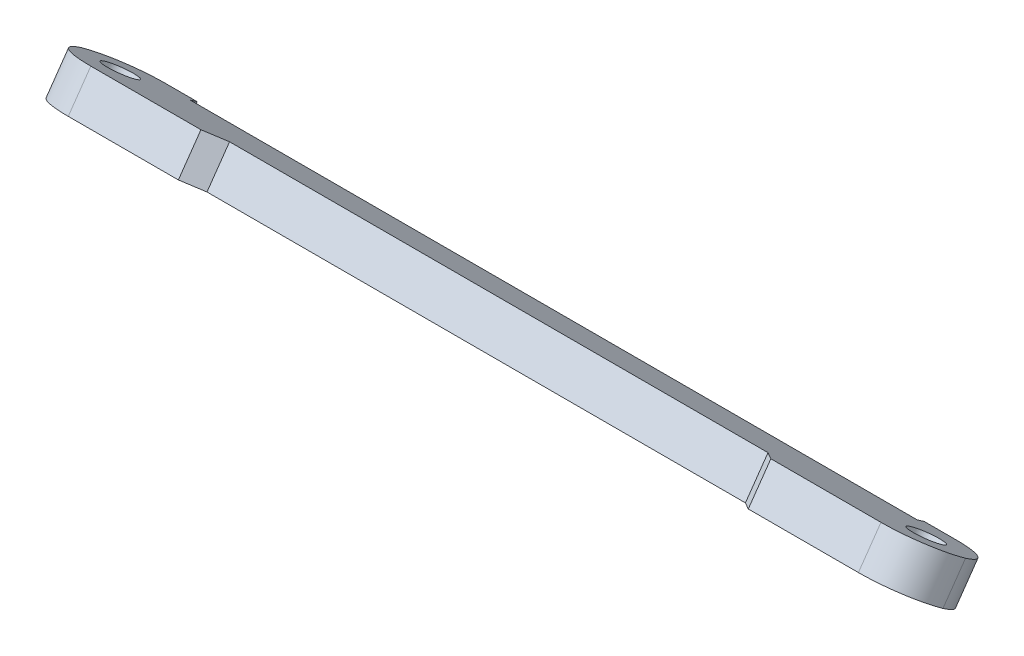
ISO-10303-21;
HEADER;
FILE_DESCRIPTION(('STEP AP214'),'2;1');
FILE_NAME('part.step','',(''),(''),'','','');
FILE_SCHEMA(('AUTOMOTIVE_DESIGN { 1 0 10303 214 1 1 1 1 }'));
ENDSEC;
DATA;
#1=APPLICATION_CONTEXT('core data for automotive mechanical design processes');
#2=APPLICATION_PROTOCOL_DEFINITION('international standard','automotive_design',2000,#1);
#3=PRODUCT_CONTEXT('',#1,'mechanical');
#4=PRODUCT('Part','Part','',(#3));
#5=PRODUCT_RELATED_PRODUCT_CATEGORY('part','',(#4));
#6=PRODUCT_DEFINITION_FORMATION('','',#4);
#7=PRODUCT_DEFINITION_CONTEXT('part definition',#1,'design');
#8=PRODUCT_DEFINITION('design','',#6,#7);
#9=PRODUCT_DEFINITION_SHAPE('','',#8);
#10=(LENGTH_UNIT() NAMED_UNIT(*) SI_UNIT(.MILLI.,.METRE.));
#11=(NAMED_UNIT(*) PLANE_ANGLE_UNIT() SI_UNIT($,.RADIAN.));
#12=(NAMED_UNIT(*) SI_UNIT($,.STERADIAN.) SOLID_ANGLE_UNIT());
#13=UNCERTAINTY_MEASURE_WITH_UNIT(LENGTH_MEASURE(1.E-05),#10,'distance_accuracy_value','');
#14=(GEOMETRIC_REPRESENTATION_CONTEXT(3) GLOBAL_UNCERTAINTY_ASSIGNED_CONTEXT((#13)) GLOBAL_UNIT_ASSIGNED_CONTEXT((#10,
#11,#12)) REPRESENTATION_CONTEXT('',''));
#15=CARTESIAN_POINT('',(0.,0.,0.));
#16=DIRECTION('',(0.,0.,1.));
#17=DIRECTION('',(1.,0.,0.));
#18=AXIS2_PLACEMENT_3D('',#15,#16,#17);
#19=CARTESIAN_POINT('',(0.,-6.96279237645662,4.87539970898395));
#20=DIRECTION('',(0.,-0.819152044288996,0.57357643635104));
#21=DIRECTION('',(0.,-0.57357643635104,-0.819152044288996));
#22=AXIS2_PLACEMENT_3D('',#19,#20,#21);
#23=PLANE('',#22);
#24=DIRECTION('',(1.,0.,0.));
#25=VECTOR('',#24,1.);
#26=CARTESIAN_POINT('',(56.2272925792625,-61.3939853444137,-72.8604000328006));
#27=LINE('',#26,#25);
#28=CARTESIAN_POINT('',(46.2272925792625,-61.3939853444137,-72.8604000328006));
#29=VERTEX_POINT('',#28);
#30=CARTESIAN_POINT('',(50.2272925792626,-61.3939853444137,-72.8604000328006));
#31=VERTEX_POINT('',#30);
#32=EDGE_CURVE('E152',#29,#31,#27,.T.);
#33=ORIENTED_EDGE('',*,*,#32,.T.);
#34=CARTESIAN_POINT('',(50.2272925792625,-57.9525267263075,-67.9454877670666));
#35=DIRECTION('',(0.,-0.819152044288996,0.57357643635104));
#36=DIRECTION('',(0.,-0.57357643635104,-0.819152044288996));
#37=AXIS2_PLACEMENT_3D('',#34,#35,#36);
#38=CIRCLE('',#37,6.);
#39=CARTESIAN_POINT('',(56.2240737994074,-58.0652385062237,-68.1064568708903));
#40=VERTEX_POINT('',#39);
#41=EDGE_CURVE('E50',#31,#40,#38,.T.);
#42=ORIENTED_EDGE('',*,*,#41,.T.);
#43=CARTESIAN_POINT('',(50.2272925792625,-58.1779502861398,-68.2674259747139));
#44=DIRECTION('',(0.,-0.819152044288996,0.57357643635104));
#45=DIRECTION('',(0.,-0.57357643635104,-0.819152044288996));
#46=AXIS2_PLACEMENT_3D('',#43,#44,#45);
#47=CIRCLE('',#46,6.);
#48=CARTESIAN_POINT('',(50.2272925792625,-54.7364916680336,-63.3525137089799));
#49=VERTEX_POINT('',#48);
#50=EDGE_CURVE('E223',#40,#49,#47,.T.);
#51=ORIENTED_EDGE('',*,*,#50,.T.);
#52=DIRECTION('',(-1.,0.,0.));
#53=VECTOR('',#52,1.);
#54=CARTESIAN_POINT('',(36.2272925792625,-54.7364916680336,-63.3525137089799));
#55=LINE('',#54,#53);
#56=CARTESIAN_POINT('',(36.2272925792625,-54.7364916680336,-63.3525137089799));
#57=VERTEX_POINT('',#56);
#58=EDGE_CURVE('E267',#49,#57,#55,.T.);
#59=ORIENTED_EDGE('',*,*,#58,.T.);
#60=DIRECTION('',(-0.707106781186548,-0.405579787672634,-0.579227965339572));
#61=VECTOR('',#60,1.);
#62=CARTESIAN_POINT('',(36.2272925792625,-54.7364916680336,-63.3525137089799));
#63=LINE('',#62,#61);
#64=CARTESIAN_POINT('',(34.2272925792625,-55.8836445407357,-64.9908177975579));
#65=VERTEX_POINT('',#64);
#66=EDGE_CURVE('E200',#57,#65,#63,.T.);
#67=ORIENTED_EDGE('',*,*,#66,.T.);
#68=DIRECTION('',(-1.,0.,0.));
#69=VECTOR('',#68,1.);
#70=CARTESIAN_POINT('',(-36.2272925792626,-55.8836445407357,-64.9908177975579));
#71=LINE('',#70,#69);
#72=CARTESIAN_POINT('',(-34.2272925792625,-55.8836445407357,-64.9908177975579));
#73=VERTEX_POINT('',#72);
#74=EDGE_CURVE('E159',#65,#73,#71,.T.);
#75=ORIENTED_EDGE('',*,*,#74,.T.);
#76=DIRECTION('',(-0.707106781186551,0.405579787672633,0.579227965339569));
#77=VECTOR('',#76,1.);
#78=CARTESIAN_POINT('',(-34.2272925792625,-55.8836445407357,-64.9908177975579));
#79=LINE('',#78,#77);
#80=CARTESIAN_POINT('',(-36.2272925792626,-54.7364916680336,-63.3525137089799));
#81=VERTEX_POINT('',#80);
#82=EDGE_CURVE('E205',#73,#81,#79,.T.);
#83=ORIENTED_EDGE('',*,*,#82,.T.);
#84=DIRECTION('',(-1.,0.,0.));
#85=VECTOR('',#84,1.);
#86=CARTESIAN_POINT('',(-36.2272925792626,-54.7364916680336,-63.3525137089799));
#87=LINE('',#86,#85);
#88=CARTESIAN_POINT('',(-50.2272925792626,-54.7364916680336,-63.3525137089799));
#89=VERTEX_POINT('',#88);
#90=EDGE_CURVE('E177',#81,#89,#87,.T.);
#91=ORIENTED_EDGE('',*,*,#90,.T.);
#92=CARTESIAN_POINT('',(-50.2272925792626,-58.1779502861398,-68.2674259747138));
#93=DIRECTION('',(0.,-0.819152044288996,0.57357643635104));
#94=DIRECTION('',(0.,-0.57357643635104,-0.819152044288996));
#95=AXIS2_PLACEMENT_3D('',#92,#93,#94);
#96=CIRCLE('',#95,6.);
#97=CARTESIAN_POINT('',(-56.2240737994074,-58.0652385062236,-68.1064568708902));
#98=VERTEX_POINT('',#97);
#99=EDGE_CURVE('E57',#89,#98,#96,.T.);
#100=ORIENTED_EDGE('',*,*,#99,.T.);
#101=CARTESIAN_POINT('',(-50.2272925792626,-57.9525267263075,-67.9454877670666));
#102=DIRECTION('',(0.,-0.819152044288996,0.57357643635104));
#103=DIRECTION('',(0.,-0.57357643635104,-0.819152044288996));
#104=AXIS2_PLACEMENT_3D('',#101,#102,#103);
#105=CIRCLE('',#104,6.);
#106=CARTESIAN_POINT('',(-50.2272925792627,-61.3939853444137,-72.8604000328006));
#107=VERTEX_POINT('',#106);
#108=EDGE_CURVE('E220',#98,#107,#105,.T.);
#109=ORIENTED_EDGE('',*,*,#108,.T.);
#110=DIRECTION('',(1.,0.,0.));
#111=VECTOR('',#110,1.);
#112=CARTESIAN_POINT('',(-56.2272925792626,-61.3939853444137,-72.8604000328005));
#113=LINE('',#112,#111);
#114=CARTESIAN_POINT('',(-46.2272925792625,-61.3939853444137,-72.8604000328006));
#115=VERTEX_POINT('',#114);
#116=EDGE_CURVE('E179',#107,#115,#113,.T.);
#117=ORIENTED_EDGE('',*,*,#116,.T.);
#118=DIRECTION('',(0.,0.573576436351034,0.819152044289));
#119=VECTOR('',#118,1.);
#120=CARTESIAN_POINT('',(-46.2272925792625,-61.3939853444137,-72.8604000328006));
#121=LINE('',#120,#119);
#122=CARTESIAN_POINT('',(-46.2272925792625,-60.7608298351204,-71.9561602542456));
#123=VERTEX_POINT('',#122);
#124=EDGE_CURVE('E138',#115,#123,#121,.T.);
#125=ORIENTED_EDGE('',*,*,#124,.T.);
#126=DIRECTION('',(1.,0.,0.));
#127=VECTOR('',#126,1.);
#128=CARTESIAN_POINT('',(-46.2272925792625,-60.7608298351204,-71.9561602542456));
#129=LINE('',#128,#127);
#130=CARTESIAN_POINT('',(46.2272925792625,-60.7608298351204,-71.9561602542456));
#131=VERTEX_POINT('',#130);
#132=EDGE_CURVE('E132',#123,#131,#129,.T.);
#133=ORIENTED_EDGE('',*,*,#132,.T.);
#134=DIRECTION('',(0.,-0.573576436351034,-0.819152044289));
#135=VECTOR('',#134,1.);
#136=CARTESIAN_POINT('',(46.2272925792625,-61.3939853444137,-72.8604000328006));
#137=LINE('',#136,#135);
#138=EDGE_CURVE('E135',#131,#29,#137,.T.);
#139=ORIENTED_EDGE('',*,*,#138,.T.);
#140=EDGE_LOOP('',(#33,#42,#51,#59,#67,#75,#83,#91,#100,#109,#117,#125,#133,#139));
#141=FACE_BOUND('',#140,.T.);
#142=CARTESIAN_POINT('',(-51.2272925792626,-58.0652385062236,-68.1064568708902));
#143=DIRECTION('',(0.,-0.819152044288996,0.57357643635104));
#144=DIRECTION('',(0.,-0.57357643635104,-0.819152044288996));
#145=AXIS2_PLACEMENT_3D('',#142,#143,#144);
#146=CIRCLE('',#145,2.);
#147=CARTESIAN_POINT('',(-51.2272925792626,-59.2123913789257,-69.7447609594682));
#148=VERTEX_POINT('',#147);
#149=EDGE_CURVE('E171',#148,#148,#146,.T.);
#150=ORIENTED_EDGE('',*,*,#149,.F.);
#151=EDGE_LOOP('',(#150));
#152=FACE_BOUND('',#151,.T.);
#153=CARTESIAN_POINT('',(51.2272925792626,-58.0652385062236,-68.1064568708902));
#154=DIRECTION('',(0.,-0.819152044288996,0.57357643635104));
#155=DIRECTION('',(0.,0.57357643635104,0.819152044288996));
#156=AXIS2_PLACEMENT_3D('',#153,#154,#155);
#157=CIRCLE('',#156,2.);
#158=CARTESIAN_POINT('',(51.2272925792626,-56.9180856335215,-66.4681527823122));
#159=VERTEX_POINT('',#158);
#160=EDGE_CURVE('E236',#159,#159,#157,.T.);
#161=ORIENTED_EDGE('',*,*,#160,.F.);
#162=EDGE_LOOP('',(#161));
#163=FACE_BOUND('',#162,.T.);
#164=ADVANCED_FACE('F33',(#141,#152,#163),#23,.T.);
#165=CARTESIAN_POINT('',(0.,-2.86703215501164,2.00751752722875));
#166=DIRECTION('',(0.,-0.819152044288996,0.57357643635104));
#167=DIRECTION('',(0.,-0.57357643635104,-0.819152044288996));
#168=AXIS2_PLACEMENT_3D('',#165,#166,#167);
#169=PLANE('',#168);
#170=CARTESIAN_POINT('',(50.2272925792625,-54.0821900646949,-71.1353081564691));
#171=DIRECTION('',(0.,-0.819152044288996,0.57357643635104));
#172=DIRECTION('',(0.,-0.57357643635104,-0.819152044288996));
#173=AXIS2_PLACEMENT_3D('',#170,#171,#172);
#174=CIRCLE('',#173,6.);
#175=CARTESIAN_POINT('',(50.2272925792625,-50.6407314465886,-66.2203958907351));
#176=VERTEX_POINT('',#175);
#177=CARTESIAN_POINT('',(56.2240737994074,-53.9694782847787,-70.9743390526455));
#178=VERTEX_POINT('',#177);
#179=EDGE_CURVE('E213',#176,#178,#174,.F.);
#180=ORIENTED_EDGE('',*,*,#179,.T.);
#181=CARTESIAN_POINT('',(50.2272925792625,-53.8567665048625,-70.8133699488218));
#182=DIRECTION('',(0.,-0.819152044288996,0.57357643635104));
#183=DIRECTION('',(0.,-0.57357643635104,-0.819152044288996));
#184=AXIS2_PLACEMENT_3D('',#181,#182,#183);
#185=CIRCLE('',#184,6.);
#186=CARTESIAN_POINT('',(50.2272925792626,-57.2982251229687,-75.7282822145558));
#187=VERTEX_POINT('',#186);
#188=EDGE_CURVE('E215',#178,#187,#185,.F.);
#189=ORIENTED_EDGE('',*,*,#188,.T.);
#190=DIRECTION('',(1.,0.,0.));
#191=VECTOR('',#190,1.);
#192=CARTESIAN_POINT('',(56.2272925792625,-57.2982251229687,-75.7282822145558));
#193=LINE('',#192,#191);
#194=CARTESIAN_POINT('',(46.2272925792625,-57.2982251229688,-75.7282822145558));
#195=VERTEX_POINT('',#194);
#196=EDGE_CURVE('E261',#195,#187,#193,.T.);
#197=ORIENTED_EDGE('',*,*,#196,.F.);
#198=DIRECTION('',(0.,-0.573576436351034,-0.819152044289));
#199=VECTOR('',#198,1.);
#200=CARTESIAN_POINT('',(46.2272925792625,-57.2982251229688,-75.7282822145558));
#201=LINE('',#200,#199);
#202=CARTESIAN_POINT('',(46.2272925792625,-56.6650696136755,-74.8240424360008));
#203=VERTEX_POINT('',#202);
#204=EDGE_CURVE('E259',#203,#195,#201,.T.);
#205=ORIENTED_EDGE('',*,*,#204,.F.);
#206=DIRECTION('',(1.,0.,0.));
#207=VECTOR('',#206,1.);
#208=CARTESIAN_POINT('',(-46.2272925792625,-56.6650696136755,-74.8240424360008));
#209=LINE('',#208,#207);
#210=CARTESIAN_POINT('',(-46.2272925792625,-56.6650696136755,-74.8240424360008));
#211=VERTEX_POINT('',#210);
#212=EDGE_CURVE('E157',#211,#203,#209,.T.);
#213=ORIENTED_EDGE('',*,*,#212,.F.);
#214=DIRECTION('',(0.,0.573576436351034,0.819152044289));
#215=VECTOR('',#214,1.);
#216=CARTESIAN_POINT('',(-46.2272925792625,-57.2982251229688,-75.7282822145558));
#217=LINE('',#216,#215);
#218=CARTESIAN_POINT('',(-46.2272925792625,-57.2982251229688,-75.7282822145558));
#219=VERTEX_POINT('',#218);
#220=EDGE_CURVE('E186',#219,#211,#217,.T.);
#221=ORIENTED_EDGE('',*,*,#220,.F.);
#222=DIRECTION('',(1.,0.,0.));
#223=VECTOR('',#222,1.);
#224=CARTESIAN_POINT('',(-56.2272925792626,-57.2982251229687,-75.7282822145557));
#225=LINE('',#224,#223);
#226=CARTESIAN_POINT('',(-50.2272925792627,-57.2982251229687,-75.7282822145558));
#227=VERTEX_POINT('',#226);
#228=EDGE_CURVE('E184',#227,#219,#225,.T.);
#229=ORIENTED_EDGE('',*,*,#228,.F.);
#230=CARTESIAN_POINT('',(-50.2272925792626,-53.8567665048625,-70.8133699488218));
#231=DIRECTION('',(0.,-0.819152044288996,0.57357643635104));
#232=DIRECTION('',(0.,-0.57357643635104,-0.819152044288996));
#233=AXIS2_PLACEMENT_3D('',#230,#231,#232);
#234=CIRCLE('',#233,6.);
#235=CARTESIAN_POINT('',(-56.2240737994074,-53.9694782847787,-70.9743390526454));
#236=VERTEX_POINT('',#235);
#237=EDGE_CURVE('E209',#227,#236,#234,.F.);
#238=ORIENTED_EDGE('',*,*,#237,.T.);
#239=CARTESIAN_POINT('',(-50.2272925792626,-54.0821900646948,-71.135308156469));
#240=DIRECTION('',(0.,-0.819152044288996,0.57357643635104));
#241=DIRECTION('',(0.,-0.57357643635104,-0.819152044288996));
#242=AXIS2_PLACEMENT_3D('',#239,#240,#241);
#243=CIRCLE('',#242,6.);
#244=CARTESIAN_POINT('',(-50.2272925792626,-50.6407314465886,-66.2203958907351));
#245=VERTEX_POINT('',#244);
#246=EDGE_CURVE('E211',#236,#245,#243,.F.);
#247=ORIENTED_EDGE('',*,*,#246,.T.);
#248=DIRECTION('',(-1.,0.,0.));
#249=VECTOR('',#248,1.);
#250=CARTESIAN_POINT('',(-36.2272925792626,-50.6407314465886,-66.2203958907351));
#251=LINE('',#250,#249);
#252=CARTESIAN_POINT('',(-36.2272925792626,-50.6407314465886,-66.2203958907351));
#253=VERTEX_POINT('',#252);
#254=EDGE_CURVE('E174',#253,#245,#251,.T.);
#255=ORIENTED_EDGE('',*,*,#254,.F.);
#256=DIRECTION('',(0.707106781186551,-0.405579787672633,-0.579227965339569));
#257=VECTOR('',#256,1.);
#258=CARTESIAN_POINT('',(-59.7590977620644,-37.1434424889303,-46.9442695694328));
#259=LINE('',#258,#257);
#260=CARTESIAN_POINT('',(-34.2272925792625,-51.7878843192907,-67.8586999793131));
#261=VERTEX_POINT('',#260);
#262=EDGE_CURVE('E207',#253,#261,#259,.T.);
#263=ORIENTED_EDGE('',*,*,#262,.T.);
#264=DIRECTION('',(-1.,0.,0.));
#265=VECTOR('',#264,1.);
#266=CARTESIAN_POINT('',(-36.2272925792626,-51.7878843192907,-67.8586999793131));
#267=LINE('',#266,#265);
#268=CARTESIAN_POINT('',(34.2272925792625,-51.7878843192907,-67.8586999793131));
#269=VERTEX_POINT('',#268);
#270=EDGE_CURVE('E162',#269,#261,#267,.T.);
#271=ORIENTED_EDGE('',*,*,#270,.F.);
#272=DIRECTION('',(0.707106781186548,0.405579787672634,0.579227965339572));
#273=VECTOR('',#272,1.);
#274=CARTESIAN_POINT('',(59.7590977620646,-37.1434424889301,-46.9442695694324));
#275=LINE('',#274,#273);
#276=CARTESIAN_POINT('',(36.2272925792625,-50.6407314465886,-66.2203958907351));
#277=VERTEX_POINT('',#276);
#278=EDGE_CURVE('E202',#269,#277,#275,.T.);
#279=ORIENTED_EDGE('',*,*,#278,.T.);
#280=DIRECTION('',(-1.,0.,0.));
#281=VECTOR('',#280,1.);
#282=CARTESIAN_POINT('',(36.2272925792625,-50.6407314465886,-66.2203958907351));
#283=LINE('',#282,#281);
#284=EDGE_CURVE('E153',#176,#277,#283,.T.);
#285=ORIENTED_EDGE('',*,*,#284,.F.);
#286=EDGE_LOOP('',(#180,#189,#197,#205,#213,#221,#229,#238,#247,#255,#263,#271,#279,#285));
#287=FACE_BOUND('',#286,.T.);
#288=CARTESIAN_POINT('',(-51.2272925792626,-53.9694782847786,-70.9743390526454));
#289=DIRECTION('',(0.,-0.819152044288996,0.57357643635104));
#290=DIRECTION('',(0.,-0.57357643635104,-0.819152044288996));
#291=AXIS2_PLACEMENT_3D('',#288,#289,#290);
#292=CIRCLE('',#291,2.);
#293=CARTESIAN_POINT('',(-51.2272925792626,-55.1166311574807,-72.6126431412234));
#294=VERTEX_POINT('',#293);
#295=EDGE_CURVE('E169',#294,#294,#292,.T.);
#296=ORIENTED_EDGE('',*,*,#295,.T.);
#297=EDGE_LOOP('',(#296));
#298=FACE_BOUND('',#297,.T.);
#299=CARTESIAN_POINT('',(51.2272925792626,-53.9694782847786,-70.9743390526454));
#300=DIRECTION('',(0.,-0.819152044288996,0.57357643635104));
#301=DIRECTION('',(0.,0.57357643635104,0.819152044288996));
#302=AXIS2_PLACEMENT_3D('',#299,#300,#301);
#303=CIRCLE('',#302,2.);
#304=CARTESIAN_POINT('',(51.2272925792626,-52.8223254120765,-69.3360349640674));
#305=VERTEX_POINT('',#304);
#306=EDGE_CURVE('E231',#305,#305,#303,.T.);
#307=ORIENTED_EDGE('',*,*,#306,.T.);
#308=EDGE_LOOP('',(#307));
#309=FACE_BOUND('',#308,.T.);
#310=ADVANCED_FACE('F256',(#287,#298,#309),#169,.F.);
#311=CARTESIAN_POINT('',(-36.2272925792626,-54.7364916680336,-63.3525137089799));
#312=DIRECTION('',(0.,-0.57357643635104,-0.819152044288996));
#313=DIRECTION('',(0.,0.819152044288996,-0.57357643635104));
#314=AXIS2_PLACEMENT_3D('',#311,#312,#313);
#315=PLANE('',#314);
#316=ORIENTED_EDGE('',*,*,#254,.T.);
#317=DIRECTION('',(0.,0.819152044288996,-0.57357643635104));
#318=VECTOR('',#317,1.);
#319=CARTESIAN_POINT('',(-50.2272925792626,-54.7364916680336,-63.3525137089799));
#320=LINE('',#319,#318);
#321=EDGE_CURVE('E42',#245,#89,#320,.F.);
#322=ORIENTED_EDGE('',*,*,#321,.T.);
#323=ORIENTED_EDGE('',*,*,#90,.F.);
#324=DIRECTION('',(0.,0.819152044288996,-0.57357643635104));
#325=VECTOR('',#324,1.);
#326=CARTESIAN_POINT('',(-36.2272925792626,-54.7364916680336,-63.3525137089799));
#327=LINE('',#326,#325);
#328=EDGE_CURVE('E143',#81,#253,#327,.T.);
#329=ORIENTED_EDGE('',*,*,#328,.T.);
#330=EDGE_LOOP('',(#316,#322,#323,#329));
#331=FACE_BOUND('',#330,.T.);
#332=ADVANCED_FACE('F298',(#331),#315,.F.);
#333=CARTESIAN_POINT('',(-56.2272925792626,-61.3939853444137,-72.8604000328005));
#334=DIRECTION('',(0.,0.57357643635104,0.819152044288996));
#335=DIRECTION('',(0.,-0.819152044288996,0.57357643635104));
#336=AXIS2_PLACEMENT_3D('',#333,#334,#335);
#337=PLANE('',#336);
#338=ORIENTED_EDGE('',*,*,#116,.F.);
#339=DIRECTION('',(0.,0.819152044288996,-0.57357643635104));
#340=VECTOR('',#339,1.);
#341=CARTESIAN_POINT('',(-50.2272925792627,-61.3939853444137,-72.8604000328006));
#342=LINE('',#341,#340);
#343=EDGE_CURVE('E11',#107,#227,#342,.T.);
#344=ORIENTED_EDGE('',*,*,#343,.T.);
#345=ORIENTED_EDGE('',*,*,#228,.T.);
#346=DIRECTION('',(0.,0.819152044288996,-0.57357643635104));
#347=VECTOR('',#346,1.);
#348=CARTESIAN_POINT('',(-46.2272925792625,-61.3939853444137,-72.8604000328006));
#349=LINE('',#348,#347);
#350=EDGE_CURVE('E192',#115,#219,#349,.T.);
#351=ORIENTED_EDGE('',*,*,#350,.F.);
#352=EDGE_LOOP('',(#338,#344,#345,#351));
#353=FACE_BOUND('',#352,.T.);
#354=ADVANCED_FACE('F250',(#353),#337,.F.);
#355=CARTESIAN_POINT('',(-46.2272925792625,-61.3939853444137,-72.8604000328006));
#356=DIRECTION('',(-1.,0.,0.));
#357=DIRECTION('',(0.,0.,1.));
#358=AXIS2_PLACEMENT_3D('',#355,#356,#357);
#359=PLANE('',#358);
#360=ORIENTED_EDGE('',*,*,#220,.T.);
#361=DIRECTION('',(0.,0.819152044288996,-0.57357643635104));
#362=VECTOR('',#361,1.);
#363=CARTESIAN_POINT('',(-46.2272925792625,-60.7608298351204,-71.9561602542456));
#364=LINE('',#363,#362);
#365=EDGE_CURVE('E190',#123,#211,#364,.T.);
#366=ORIENTED_EDGE('',*,*,#365,.F.);
#367=ORIENTED_EDGE('',*,*,#124,.F.);
#368=ORIENTED_EDGE('',*,*,#350,.T.);
#369=EDGE_LOOP('',(#360,#366,#367,#368));
#370=FACE_BOUND('',#369,.T.);
#371=ADVANCED_FACE('F254',(#370),#359,.F.);
#372=CARTESIAN_POINT('',(-46.2272925792625,-60.7608298351204,-71.9561602542456));
#373=DIRECTION('',(0.,0.57357643635104,0.819152044288996));
#374=DIRECTION('',(0.,-0.819152044288996,0.57357643635104));
#375=AXIS2_PLACEMENT_3D('',#372,#373,#374);
#376=PLANE('',#375);
#377=ORIENTED_EDGE('',*,*,#212,.T.);
#378=DIRECTION('',(0.,0.819152044288996,-0.57357643635104));
#379=VECTOR('',#378,1.);
#380=CARTESIAN_POINT('',(46.2272925792625,-60.7608298351204,-71.9561602542456));
#381=LINE('',#380,#379);
#382=EDGE_CURVE('E148',#131,#203,#381,.T.);
#383=ORIENTED_EDGE('',*,*,#382,.F.);
#384=ORIENTED_EDGE('',*,*,#132,.F.);
#385=ORIENTED_EDGE('',*,*,#365,.T.);
#386=EDGE_LOOP('',(#377,#383,#384,#385));
#387=FACE_BOUND('',#386,.T.);
#388=ADVANCED_FACE('F155',(#387),#376,.F.);
#389=CARTESIAN_POINT('',(-51.2272925792626,-58.0652385062236,-68.1064568708902));
#390=DIRECTION('',(0.,0.819152044288996,-0.57357643635104));
#391=DIRECTION('',(0.,0.57357643635104,0.819152044288996));
#392=AXIS2_PLACEMENT_3D('',#389,#390,#391);
#393=CYLINDRICAL_SURFACE('',#392,2.);
#394=ORIENTED_EDGE('',*,*,#149,.T.);
#395=EDGE_LOOP('',(#394));
#396=FACE_BOUND('',#395,.T.);
#397=ORIENTED_EDGE('',*,*,#295,.F.);
#398=EDGE_LOOP('',(#397));
#399=FACE_BOUND('',#398,.T.);
#400=ADVANCED_FACE('F319',(#396,#399),#393,.F.);
#401=CARTESIAN_POINT('',(-36.2272925792626,-51.7878843192907,-67.8586999793131));
#402=DIRECTION('',(0.,0.57357643635104,0.819152044288996));
#403=DIRECTION('',(0.,-0.819152044288996,0.57357643635104));
#404=AXIS2_PLACEMENT_3D('',#401,#402,#403);
#405=PLANE('',#404);
#406=ORIENTED_EDGE('',*,*,#74,.F.);
#407=DIRECTION('',(0.,0.819152044288996,-0.57357643635104));
#408=VECTOR('',#407,1.);
#409=CARTESIAN_POINT('',(34.2272925792625,-51.7878843192907,-67.8586999793131));
#410=LINE('',#409,#408);
#411=EDGE_CURVE('E198',#65,#269,#410,.T.);
#412=ORIENTED_EDGE('',*,*,#411,.T.);
#413=ORIENTED_EDGE('',*,*,#270,.T.);
#414=DIRECTION('',(0.,-0.819152044288996,0.57357643635104));
#415=VECTOR('',#414,1.);
#416=CARTESIAN_POINT('',(-34.2272925792625,-51.7878843192907,-67.8586999793131));
#417=LINE('',#416,#415);
#418=EDGE_CURVE('E195',#261,#73,#417,.T.);
#419=ORIENTED_EDGE('',*,*,#418,.T.);
#420=EDGE_LOOP('',(#406,#412,#413,#419));
#421=FACE_BOUND('',#420,.T.);
#422=ADVANCED_FACE('F292',(#421),#405,.T.);
#423=CARTESIAN_POINT('',(46.2272925792625,-61.3939853444137,-72.8604000328006));
#424=DIRECTION('',(1.,0.,0.));
#425=DIRECTION('',(0.,0.,-1.));
#426=AXIS2_PLACEMENT_3D('',#423,#424,#425);
#427=PLANE('',#426);
#428=ORIENTED_EDGE('',*,*,#204,.T.);
#429=DIRECTION('',(0.,0.819152044288996,-0.57357643635104));
#430=VECTOR('',#429,1.);
#431=CARTESIAN_POINT('',(46.2272925792625,-61.3939853444137,-72.8604000328006));
#432=LINE('',#431,#430);
#433=EDGE_CURVE('E150',#29,#195,#432,.T.);
#434=ORIENTED_EDGE('',*,*,#433,.F.);
#435=ORIENTED_EDGE('',*,*,#138,.F.);
#436=ORIENTED_EDGE('',*,*,#382,.T.);
#437=EDGE_LOOP('',(#428,#434,#435,#436));
#438=FACE_BOUND('',#437,.T.);
#439=ADVANCED_FACE('F147',(#438),#427,.F.);
#440=CARTESIAN_POINT('',(56.2272925792625,-61.3939853444137,-72.8604000328006));
#441=DIRECTION('',(0.,0.57357643635104,0.819152044288996));
#442=DIRECTION('',(0.,-0.819152044288996,0.57357643635104));
#443=AXIS2_PLACEMENT_3D('',#440,#441,#442);
#444=PLANE('',#443);
#445=ORIENTED_EDGE('',*,*,#196,.T.);
#446=DIRECTION('',(0.,0.819152044288996,-0.57357643635104));
#447=VECTOR('',#446,1.);
#448=CARTESIAN_POINT('',(50.2272925792626,-61.3939853444137,-72.8604000328006));
#449=LINE('',#448,#447);
#450=EDGE_CURVE('E217',#187,#31,#449,.F.);
#451=ORIENTED_EDGE('',*,*,#450,.T.);
#452=ORIENTED_EDGE('',*,*,#32,.F.);
#453=ORIENTED_EDGE('',*,*,#433,.T.);
#454=EDGE_LOOP('',(#445,#451,#452,#453));
#455=FACE_BOUND('',#454,.T.);
#456=ADVANCED_FACE('F277',(#455),#444,.F.);
#457=CARTESIAN_POINT('',(36.2272925792625,-54.7364916680336,-63.3525137089799));
#458=DIRECTION('',(0.,-0.57357643635104,-0.819152044288996));
#459=DIRECTION('',(0.,0.819152044288996,-0.57357643635104));
#460=AXIS2_PLACEMENT_3D('',#457,#458,#459);
#461=PLANE('',#460);
#462=ORIENTED_EDGE('',*,*,#58,.F.);
#463=DIRECTION('',(0.,0.819152044288996,-0.57357643635104));
#464=VECTOR('',#463,1.);
#465=CARTESIAN_POINT('',(50.2272925792625,-54.7364916680336,-63.3525137089799));
#466=LINE('',#465,#464);
#467=EDGE_CURVE('E226',#49,#176,#466,.T.);
#468=ORIENTED_EDGE('',*,*,#467,.T.);
#469=ORIENTED_EDGE('',*,*,#284,.T.);
#470=DIRECTION('',(0.,0.819152044288996,-0.57357643635104));
#471=VECTOR('',#470,1.);
#472=CARTESIAN_POINT('',(36.2272925792625,-54.7364916680336,-63.3525137089799));
#473=LINE('',#472,#471);
#474=EDGE_CURVE('E164',#57,#277,#473,.T.);
#475=ORIENTED_EDGE('',*,*,#474,.F.);
#476=EDGE_LOOP('',(#462,#468,#469,#475));
#477=FACE_BOUND('',#476,.T.);
#478=ADVANCED_FACE('F286',(#477),#461,.F.);
#479=CARTESIAN_POINT('',(51.2272925792626,-58.0652385062236,-68.1064568708902));
#480=DIRECTION('',(0.,0.819152044288996,-0.57357643635104));
#481=DIRECTION('',(0.,0.57357643635104,0.819152044288996));
#482=AXIS2_PLACEMENT_3D('',#479,#480,#481);
#483=CYLINDRICAL_SURFACE('',#482,2.);
#484=ORIENTED_EDGE('',*,*,#160,.T.);
#485=EDGE_LOOP('',(#484));
#486=FACE_BOUND('',#485,.T.);
#487=ORIENTED_EDGE('',*,*,#306,.F.);
#488=EDGE_LOOP('',(#487));
#489=FACE_BOUND('',#488,.T.);
#490=ADVANCED_FACE('F309',(#486,#489),#483,.F.);
#491=CARTESIAN_POINT('',(36.2272925792625,-54.7364916680336,-63.3525137089799));
#492=DIRECTION('',(0.707106781186547,-0.405579787672635,-0.579227965339572));
#493=DIRECTION('',(0.,-0.819152044288996,0.57357643635104));
#494=AXIS2_PLACEMENT_3D('',#491,#492,#493);
#495=PLANE('',#494);
#496=ORIENTED_EDGE('',*,*,#278,.F.);
#497=ORIENTED_EDGE('',*,*,#411,.F.);
#498=ORIENTED_EDGE('',*,*,#66,.F.);
#499=ORIENTED_EDGE('',*,*,#474,.T.);
#500=EDGE_LOOP('',(#496,#497,#498,#499));
#501=FACE_BOUND('',#500,.T.);
#502=ADVANCED_FACE('F289',(#501),#495,.F.);
#503=CARTESIAN_POINT('',(-34.2272925792625,-51.7878843192907,-67.8586999793131));
#504=DIRECTION('',(-0.707106781186544,-0.405579787672637,-0.579227965339575));
#505=DIRECTION('',(0.,-0.819152044288996,0.57357643635104));
#506=AXIS2_PLACEMENT_3D('',#503,#504,#505);
#507=PLANE('',#506);
#508=ORIENTED_EDGE('',*,*,#262,.F.);
#509=ORIENTED_EDGE('',*,*,#328,.F.);
#510=ORIENTED_EDGE('',*,*,#82,.F.);
#511=ORIENTED_EDGE('',*,*,#418,.F.);
#512=EDGE_LOOP('',(#508,#509,#510,#511));
#513=FACE_BOUND('',#512,.T.);
#514=ADVANCED_FACE('F301',(#513),#507,.F.);
#515=CARTESIAN_POINT('',(50.2272925792625,-58.1779502861398,-68.2674259747139));
#516=DIRECTION('',(0.,0.819152044288996,-0.57357643635104));
#517=DIRECTION('',(0.,0.57357643635104,0.819152044288996));
#518=AXIS2_PLACEMENT_3D('',#515,#516,#517);
#519=CYLINDRICAL_SURFACE('',#518,6.);
#520=ORIENTED_EDGE('',*,*,#467,.F.);
#521=ORIENTED_EDGE('',*,*,#50,.F.);
#522=DIRECTION('',(0.,0.819152044288996,-0.57357643635104));
#523=VECTOR('',#522,1.);
#524=CARTESIAN_POINT('',(56.2240737994074,-56.0173583955012,-69.5403979617679));
#525=LINE('',#524,#523);
#526=EDGE_CURVE('E229',#178,#40,#525,.F.);
#527=ORIENTED_EDGE('',*,*,#526,.F.);
#528=ORIENTED_EDGE('',*,*,#179,.F.);
#529=EDGE_LOOP('',(#520,#521,#527,#528));
#530=FACE_BOUND('',#529,.T.);
#531=ADVANCED_FACE('F284',(#530),#519,.T.);
#532=CARTESIAN_POINT('',(50.2272925792625,-57.9525267263075,-67.9454877670667));
#533=DIRECTION('',(0.,0.819152044288996,-0.57357643635104));
#534=DIRECTION('',(0.,0.57357643635104,0.819152044288996));
#535=AXIS2_PLACEMENT_3D('',#532,#533,#534);
#536=CYLINDRICAL_SURFACE('',#535,6.);
#537=ORIENTED_EDGE('',*,*,#41,.F.);
#538=ORIENTED_EDGE('',*,*,#450,.F.);
#539=ORIENTED_EDGE('',*,*,#188,.F.);
#540=ORIENTED_EDGE('',*,*,#526,.T.);
#541=EDGE_LOOP('',(#537,#538,#539,#540));
#542=FACE_BOUND('',#541,.T.);
#543=ADVANCED_FACE('F279',(#542),#536,.T.);
#544=CARTESIAN_POINT('',(-50.2272925792626,-57.9525267263075,-67.9454877670666));
#545=DIRECTION('',(0.,0.819152044288996,-0.57357643635104));
#546=DIRECTION('',(0.,0.57357643635104,0.819152044288996));
#547=AXIS2_PLACEMENT_3D('',#544,#545,#546);
#548=CYLINDRICAL_SURFACE('',#547,6.);
#549=ORIENTED_EDGE('',*,*,#343,.F.);
#550=ORIENTED_EDGE('',*,*,#108,.F.);
#551=DIRECTION('',(0.,0.819152044288996,-0.57357643635104));
#552=VECTOR('',#551,1.);
#553=CARTESIAN_POINT('',(-56.2240737994074,-56.0173583955011,-69.5403979617678));
#554=LINE('',#553,#552);
#555=EDGE_CURVE('E37',#236,#98,#554,.F.);
#556=ORIENTED_EDGE('',*,*,#555,.F.);
#557=ORIENTED_EDGE('',*,*,#237,.F.);
#558=EDGE_LOOP('',(#549,#550,#556,#557));
#559=FACE_BOUND('',#558,.T.);
#560=ADVANCED_FACE('F35',(#559),#548,.T.);
#561=CARTESIAN_POINT('',(-50.2272925792626,-58.1779502861398,-68.2674259747138));
#562=DIRECTION('',(0.,0.819152044288996,-0.57357643635104));
#563=DIRECTION('',(0.,0.57357643635104,0.819152044288996));
#564=AXIS2_PLACEMENT_3D('',#561,#562,#563);
#565=CYLINDRICAL_SURFACE('',#564,6.);
#566=ORIENTED_EDGE('',*,*,#99,.F.);
#567=ORIENTED_EDGE('',*,*,#321,.F.);
#568=ORIENTED_EDGE('',*,*,#246,.F.);
#569=ORIENTED_EDGE('',*,*,#555,.T.);
#570=EDGE_LOOP('',(#566,#567,#568,#569));
#571=FACE_BOUND('',#570,.T.);
#572=ADVANCED_FACE('F242',(#571),#565,.T.);
#573=CLOSED_SHELL('',(#164,#310,#332,#354,#371,#388,#400,#422,#439,#456,#478,#490,#502,#514,
#531,#543,#560,#572));
#574=MANIFOLD_SOLID_BREP('B2',#573);
#575=ADVANCED_BREP_SHAPE_REPRESENTATION('',(#18,#574),#14);
#576=SHAPE_DEFINITION_REPRESENTATION(#9,#575);
ENDSEC;
END-ISO-10303-21;
